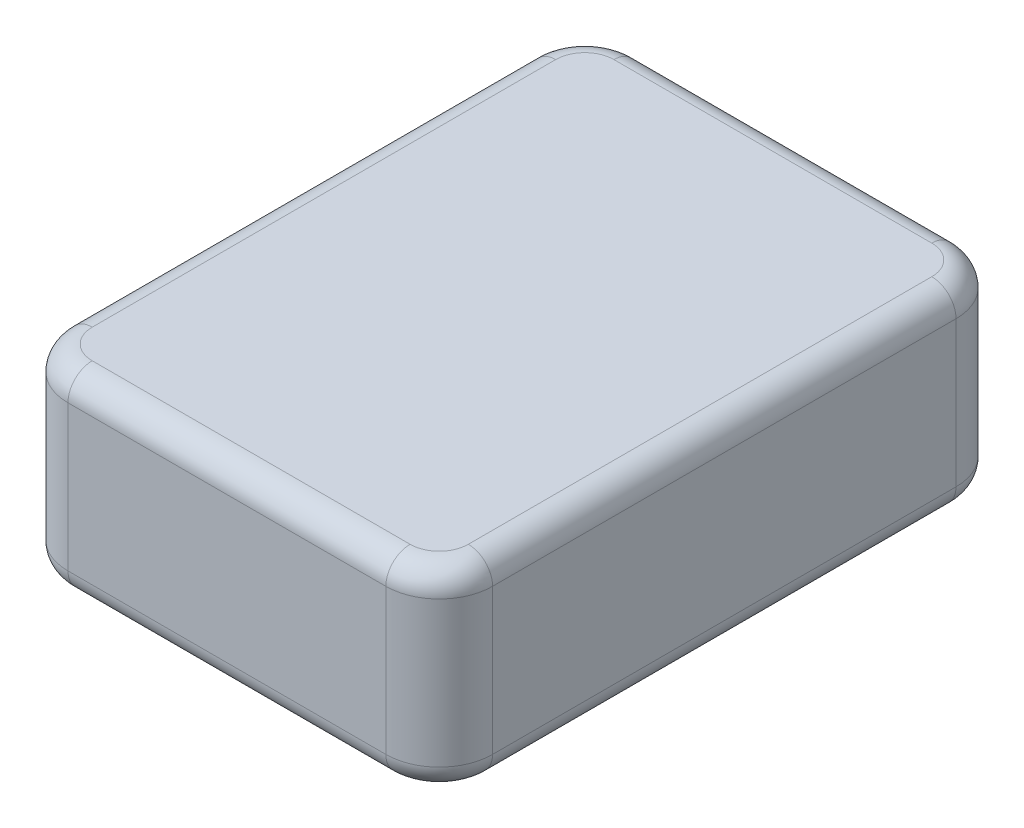
ISO-10303-21;
HEADER;
FILE_DESCRIPTION(('STEP AP214'),'2;1');
FILE_NAME('part.step','',(''),(''),'','','');
FILE_SCHEMA(('AUTOMOTIVE_DESIGN { 1 0 10303 214 1 1 1 1 }'));
ENDSEC;
DATA;
#1=APPLICATION_CONTEXT('core data for automotive mechanical design processes');
#2=APPLICATION_PROTOCOL_DEFINITION('international standard','automotive_design',2000,#1);
#3=PRODUCT_CONTEXT('',#1,'mechanical');
#4=PRODUCT('Part','Part','',(#3));
#5=PRODUCT_RELATED_PRODUCT_CATEGORY('part','',(#4));
#6=PRODUCT_DEFINITION_FORMATION('','',#4);
#7=PRODUCT_DEFINITION_CONTEXT('part definition',#1,'design');
#8=PRODUCT_DEFINITION('design','',#6,#7);
#9=PRODUCT_DEFINITION_SHAPE('','',#8);
#10=(LENGTH_UNIT() NAMED_UNIT(*) SI_UNIT(.MILLI.,.METRE.));
#11=(NAMED_UNIT(*) PLANE_ANGLE_UNIT() SI_UNIT($,.RADIAN.));
#12=(NAMED_UNIT(*) SI_UNIT($,.STERADIAN.) SOLID_ANGLE_UNIT());
#13=UNCERTAINTY_MEASURE_WITH_UNIT(LENGTH_MEASURE(1.E-05),#10,'distance_accuracy_value','');
#14=(GEOMETRIC_REPRESENTATION_CONTEXT(3) GLOBAL_UNCERTAINTY_ASSIGNED_CONTEXT((#13)) GLOBAL_UNIT_ASSIGNED_CONTEXT((#10,
#11,#12)) REPRESENTATION_CONTEXT('',''));
#15=CARTESIAN_POINT('',(0.,0.,0.));
#16=DIRECTION('',(0.,0.,1.));
#17=DIRECTION('',(1.,0.,0.));
#18=AXIS2_PLACEMENT_3D('',#15,#16,#17);
#19=CARTESIAN_POINT('',(0.,203.2,0.));
#20=DIRECTION('',(0.,0.,-1.));
#21=DIRECTION('',(-1.,0.,0.));
#22=AXIS2_PLACEMENT_3D('',#19,#20,#21);
#23=PLANE('',#22);
#24=DIRECTION('',(0.,-1.,0.));
#25=VECTOR('',#24,1.);
#26=CARTESIAN_POINT('',(55.88,0.,0.));
#27=LINE('',#26,#25);
#28=CARTESIAN_POINT('',(55.88,177.8,0.));
#29=VERTEX_POINT('',#28);
#30=CARTESIAN_POINT('',(55.88,25.4,0.));
#31=VERTEX_POINT('',#30);
#32=EDGE_CURVE('E183',#29,#31,#27,.T.);
#33=ORIENTED_EDGE('',*,*,#32,.T.);
#34=DIRECTION('',(1.,0.,0.));
#35=VECTOR('',#34,1.);
#36=CARTESIAN_POINT('',(0.,25.4,0.));
#37=LINE('',#36,#35);
#38=CARTESIAN_POINT('',(388.62,25.4,0.));
#39=VERTEX_POINT('',#38);
#40=EDGE_CURVE('E158',#31,#39,#37,.T.);
#41=ORIENTED_EDGE('',*,*,#40,.T.);
#42=DIRECTION('',(0.,-1.,0.));
#43=VECTOR('',#42,1.);
#44=CARTESIAN_POINT('',(388.62,203.2,0.));
#45=LINE('',#44,#43);
#46=CARTESIAN_POINT('',(388.62,177.8,0.));
#47=VERTEX_POINT('',#46);
#48=EDGE_CURVE('E180',#39,#47,#45,.F.);
#49=ORIENTED_EDGE('',*,*,#48,.T.);
#50=DIRECTION('',(1.,0.,0.));
#51=VECTOR('',#50,1.);
#52=CARTESIAN_POINT('',(55.88,177.8,0.));
#53=LINE('',#52,#51);
#54=EDGE_CURVE('E186',#47,#29,#53,.F.);
#55=ORIENTED_EDGE('',*,*,#54,.T.);
#56=EDGE_LOOP('',(#33,#41,#49,#55));
#57=FACE_BOUND('',#56,.T.);
#58=ADVANCED_FACE('F39',(#57),#23,.F.);
#59=CARTESIAN_POINT('',(444.5,203.2,0.));
#60=DIRECTION('',(-1.,0.,0.));
#61=DIRECTION('',(0.,0.,1.));
#62=AXIS2_PLACEMENT_3D('',#59,#60,#61);
#63=PLANE('',#62);
#64=DIRECTION('',(0.,-1.,0.));
#65=VECTOR('',#64,1.);
#66=CARTESIAN_POINT('',(444.5,203.2,-55.88));
#67=LINE('',#66,#65);
#68=CARTESIAN_POINT('',(444.5,177.8,-55.88));
#69=VERTEX_POINT('',#68);
#70=CARTESIAN_POINT('',(444.5,25.4,-55.88));
#71=VERTEX_POINT('',#70);
#72=EDGE_CURVE('E320',#69,#71,#67,.T.);
#73=ORIENTED_EDGE('',*,*,#72,.T.);
#74=DIRECTION('',(0.,0.,-1.));
#75=VECTOR('',#74,1.);
#76=CARTESIAN_POINT('',(444.5,25.4,0.));
#77=LINE('',#76,#75);
#78=CARTESIAN_POINT('',(444.5,25.4,-541.02));
#79=VERTEX_POINT('',#78);
#80=EDGE_CURVE('E212',#71,#79,#77,.T.);
#81=ORIENTED_EDGE('',*,*,#80,.T.);
#82=DIRECTION('',(0.,-1.,0.));
#83=VECTOR('',#82,1.);
#84=CARTESIAN_POINT('',(444.5,203.2,-541.02));
#85=LINE('',#84,#83);
#86=CARTESIAN_POINT('',(444.5,177.8,-541.02));
#87=VERTEX_POINT('',#86);
#88=EDGE_CURVE('E324',#79,#87,#85,.F.);
#89=ORIENTED_EDGE('',*,*,#88,.T.);
#90=DIRECTION('',(0.,0.,-1.));
#91=VECTOR('',#90,1.);
#92=CARTESIAN_POINT('',(444.5,177.8,-55.88));
#93=LINE('',#92,#91);
#94=EDGE_CURVE('E174',#87,#69,#93,.F.);
#95=ORIENTED_EDGE('',*,*,#94,.T.);
#96=EDGE_LOOP('',(#73,#81,#89,#95));
#97=FACE_BOUND('',#96,.T.);
#98=ADVANCED_FACE('F360',(#97),#63,.F.);
#99=CARTESIAN_POINT('',(0.,203.2,-596.9));
#100=DIRECTION('',(0.,0.,-1.));
#101=DIRECTION('',(-1.,0.,0.));
#102=AXIS2_PLACEMENT_3D('',#99,#100,#101);
#103=PLANE('',#102);
#104=DIRECTION('',(0.,-1.,0.));
#105=VECTOR('',#104,1.);
#106=CARTESIAN_POINT('',(388.62,0.,-596.9));
#107=LINE('',#106,#105);
#108=CARTESIAN_POINT('',(388.62,177.8,-596.9));
#109=VERTEX_POINT('',#108);
#110=CARTESIAN_POINT('',(388.62,25.4,-596.9));
#111=VERTEX_POINT('',#110);
#112=EDGE_CURVE('E318',#109,#111,#107,.T.);
#113=ORIENTED_EDGE('',*,*,#112,.T.);
#114=DIRECTION('',(1.,0.,0.));
#115=VECTOR('',#114,1.);
#116=CARTESIAN_POINT('',(55.88,25.4,-596.9));
#117=LINE('',#116,#115);
#118=CARTESIAN_POINT('',(55.88,25.4,-596.9));
#119=VERTEX_POINT('',#118);
#120=EDGE_CURVE('E221',#111,#119,#117,.F.);
#121=ORIENTED_EDGE('',*,*,#120,.T.);
#122=DIRECTION('',(0.,-1.,0.));
#123=VECTOR('',#122,1.);
#124=CARTESIAN_POINT('',(55.88,203.2,-596.9));
#125=LINE('',#124,#123);
#126=CARTESIAN_POINT('',(55.88,177.8,-596.9));
#127=VERTEX_POINT('',#126);
#128=EDGE_CURVE('E263',#119,#127,#125,.F.);
#129=ORIENTED_EDGE('',*,*,#128,.T.);
#130=DIRECTION('',(1.,0.,0.));
#131=VECTOR('',#130,1.);
#132=CARTESIAN_POINT('',(0.,177.8,-596.9));
#133=LINE('',#132,#131);
#134=EDGE_CURVE('E218',#127,#109,#133,.T.);
#135=ORIENTED_EDGE('',*,*,#134,.T.);
#136=EDGE_LOOP('',(#113,#121,#129,#135));
#137=FACE_BOUND('',#136,.T.);
#138=ADVANCED_FACE('F315',(#137),#103,.T.);
#139=CARTESIAN_POINT('',(0.,203.2,0.));
#140=DIRECTION('',(-1.,0.,0.));
#141=DIRECTION('',(0.,0.,1.));
#142=AXIS2_PLACEMENT_3D('',#139,#140,#141);
#143=PLANE('',#142);
#144=DIRECTION('',(0.,-1.,0.));
#145=VECTOR('',#144,1.);
#146=CARTESIAN_POINT('',(0.,203.2,-541.02));
#147=LINE('',#146,#145);
#148=CARTESIAN_POINT('',(0.,177.8,-541.02));
#149=VERTEX_POINT('',#148);
#150=CARTESIAN_POINT('',(0.,25.4,-541.02));
#151=VERTEX_POINT('',#150);
#152=EDGE_CURVE('E192',#149,#151,#147,.T.);
#153=ORIENTED_EDGE('',*,*,#152,.T.);
#154=DIRECTION('',(0.,0.,-1.));
#155=VECTOR('',#154,1.);
#156=CARTESIAN_POINT('',(0.,25.4,-55.88));
#157=LINE('',#156,#155);
#158=CARTESIAN_POINT('',(0.,25.4,-55.88));
#159=VERTEX_POINT('',#158);
#160=EDGE_CURVE('E229',#151,#159,#157,.F.);
#161=ORIENTED_EDGE('',*,*,#160,.T.);
#162=DIRECTION('',(0.,-1.,0.));
#163=VECTOR('',#162,1.);
#164=CARTESIAN_POINT('',(0.,203.2,-55.88));
#165=LINE('',#164,#163);
#166=CARTESIAN_POINT('',(0.,177.8,-55.88));
#167=VERTEX_POINT('',#166);
#168=EDGE_CURVE('E327',#159,#167,#165,.F.);
#169=ORIENTED_EDGE('',*,*,#168,.T.);
#170=DIRECTION('',(0.,0.,-1.));
#171=VECTOR('',#170,1.);
#172=CARTESIAN_POINT('',(0.,177.8,0.));
#173=LINE('',#172,#171);
#174=EDGE_CURVE('E227',#167,#149,#173,.T.);
#175=ORIENTED_EDGE('',*,*,#174,.T.);
#176=EDGE_LOOP('',(#153,#161,#169,#175));
#177=FACE_BOUND('',#176,.T.);
#178=ADVANCED_FACE('F331',(#177),#143,.T.);
#179=CARTESIAN_POINT('',(0.,203.2,0.));
#180=DIRECTION('',(0.,1.,0.));
#181=DIRECTION('',(0.,0.,1.));
#182=AXIS2_PLACEMENT_3D('',#179,#180,#181);
#183=PLANE('',#182);
#184=CARTESIAN_POINT('',(388.62,203.2,-541.02));
#185=DIRECTION('',(0.,1.,0.));
#186=DIRECTION('',(0.,0.,1.));
#187=AXIS2_PLACEMENT_3D('',#184,#185,#186);
#188=CIRCLE('',#187,30.48);
#189=CARTESIAN_POINT('',(419.1,203.2,-541.02));
#190=VERTEX_POINT('',#189);
#191=CARTESIAN_POINT('',(388.62,203.2,-571.5));
#192=VERTEX_POINT('',#191);
#193=EDGE_CURVE('E56',#190,#192,#188,.T.);
#194=ORIENTED_EDGE('',*,*,#193,.T.);
#195=DIRECTION('',(1.,0.,0.));
#196=VECTOR('',#195,1.);
#197=CARTESIAN_POINT('',(0.,203.2,-571.5));
#198=LINE('',#197,#196);
#199=CARTESIAN_POINT('',(55.88,203.2,-571.5));
#200=VERTEX_POINT('',#199);
#201=EDGE_CURVE('E243',#192,#200,#198,.F.);
#202=ORIENTED_EDGE('',*,*,#201,.T.);
#203=CARTESIAN_POINT('',(55.88,203.2,-541.02));
#204=DIRECTION('',(0.,1.,0.));
#205=DIRECTION('',(0.,0.,1.));
#206=AXIS2_PLACEMENT_3D('',#203,#204,#205);
#207=CIRCLE('',#206,30.48);
#208=CARTESIAN_POINT('',(25.4,203.2,-541.02));
#209=VERTEX_POINT('',#208);
#210=EDGE_CURVE('E231',#200,#209,#207,.T.);
#211=ORIENTED_EDGE('',*,*,#210,.T.);
#212=DIRECTION('',(0.,0.,-1.));
#213=VECTOR('',#212,1.);
#214=CARTESIAN_POINT('',(25.4,203.2,0.));
#215=LINE('',#214,#213);
#216=CARTESIAN_POINT('',(25.4,203.2,-55.88));
#217=VERTEX_POINT('',#216);
#218=EDGE_CURVE('E233',#209,#217,#215,.F.);
#219=ORIENTED_EDGE('',*,*,#218,.T.);
#220=CARTESIAN_POINT('',(55.88,203.2,-55.88));
#221=DIRECTION('',(0.,1.,0.));
#222=DIRECTION('',(0.,0.,1.));
#223=AXIS2_PLACEMENT_3D('',#220,#221,#222);
#224=CIRCLE('',#223,30.48);
#225=CARTESIAN_POINT('',(55.88,203.2,-25.4));
#226=VERTEX_POINT('',#225);
#227=EDGE_CURVE('E235',#217,#226,#224,.T.);
#228=ORIENTED_EDGE('',*,*,#227,.T.);
#229=DIRECTION('',(1.,0.,0.));
#230=VECTOR('',#229,1.);
#231=CARTESIAN_POINT('',(388.62,203.2,-25.4));
#232=LINE('',#231,#230);
#233=CARTESIAN_POINT('',(388.62,203.2,-25.4));
#234=VERTEX_POINT('',#233);
#235=EDGE_CURVE('E237',#226,#234,#232,.T.);
#236=ORIENTED_EDGE('',*,*,#235,.T.);
#237=CARTESIAN_POINT('',(388.62,203.2,-55.88));
#238=DIRECTION('',(0.,1.,0.));
#239=DIRECTION('',(0.,0.,1.));
#240=AXIS2_PLACEMENT_3D('',#237,#238,#239);
#241=CIRCLE('',#240,30.48);
#242=CARTESIAN_POINT('',(419.1,203.2,-55.88));
#243=VERTEX_POINT('',#242);
#244=EDGE_CURVE('E239',#234,#243,#241,.T.);
#245=ORIENTED_EDGE('',*,*,#244,.T.);
#246=DIRECTION('',(0.,0.,-1.));
#247=VECTOR('',#246,1.);
#248=CARTESIAN_POINT('',(419.1,203.2,-541.02));
#249=LINE('',#248,#247);
#250=EDGE_CURVE('E61',#243,#190,#249,.T.);
#251=ORIENTED_EDGE('',*,*,#250,.T.);
#252=EDGE_LOOP('',(#194,#202,#211,#219,#228,#236,#245,#251));
#253=FACE_BOUND('',#252,.T.);
#254=ADVANCED_FACE('F293',(#253),#183,.T.);
#255=CARTESIAN_POINT('',(0.,0.,0.));
#256=DIRECTION('',(0.,1.,0.));
#257=DIRECTION('',(0.,0.,1.));
#258=AXIS2_PLACEMENT_3D('',#255,#256,#257);
#259=PLANE('',#258);
#260=CARTESIAN_POINT('',(388.62,0.,-55.88));
#261=DIRECTION('',(0.,1.,0.));
#262=DIRECTION('',(0.,0.,1.));
#263=AXIS2_PLACEMENT_3D('',#260,#261,#262);
#264=CIRCLE('',#263,30.48);
#265=CARTESIAN_POINT('',(419.1,0.,-55.88));
#266=VERTEX_POINT('',#265);
#267=CARTESIAN_POINT('',(388.62,0.,-25.4));
#268=VERTEX_POINT('',#267);
#269=EDGE_CURVE('E207',#266,#268,#264,.F.);
#270=ORIENTED_EDGE('',*,*,#269,.T.);
#271=DIRECTION('',(1.,0.,0.));
#272=VECTOR('',#271,1.);
#273=CARTESIAN_POINT('',(0.,0.,-25.4));
#274=LINE('',#273,#272);
#275=CARTESIAN_POINT('',(55.88,0.,-25.4));
#276=VERTEX_POINT('',#275);
#277=EDGE_CURVE('E160',#268,#276,#274,.F.);
#278=ORIENTED_EDGE('',*,*,#277,.T.);
#279=CARTESIAN_POINT('',(55.88,0.,-55.88));
#280=DIRECTION('',(0.,1.,0.));
#281=DIRECTION('',(0.,0.,1.));
#282=AXIS2_PLACEMENT_3D('',#279,#280,#281);
#283=CIRCLE('',#282,30.48);
#284=CARTESIAN_POINT('',(25.4,0.,-55.88));
#285=VERTEX_POINT('',#284);
#286=EDGE_CURVE('E185',#276,#285,#283,.F.);
#287=ORIENTED_EDGE('',*,*,#286,.T.);
#288=DIRECTION('',(0.,0.,-1.));
#289=VECTOR('',#288,1.);
#290=CARTESIAN_POINT('',(25.4,0.,-541.02));
#291=LINE('',#290,#289);
#292=CARTESIAN_POINT('',(25.4,0.,-541.02));
#293=VERTEX_POINT('',#292);
#294=EDGE_CURVE('E197',#285,#293,#291,.T.);
#295=ORIENTED_EDGE('',*,*,#294,.T.);
#296=CARTESIAN_POINT('',(55.88,0.,-541.02));
#297=DIRECTION('',(0.,1.,0.));
#298=DIRECTION('',(0.,0.,1.));
#299=AXIS2_PLACEMENT_3D('',#296,#297,#298);
#300=CIRCLE('',#299,30.48);
#301=CARTESIAN_POINT('',(55.88,0.,-571.5));
#302=VERTEX_POINT('',#301);
#303=EDGE_CURVE('E199',#293,#302,#300,.F.);
#304=ORIENTED_EDGE('',*,*,#303,.T.);
#305=DIRECTION('',(1.,0.,0.));
#306=VECTOR('',#305,1.);
#307=CARTESIAN_POINT('',(388.62,0.,-571.5));
#308=LINE('',#307,#306);
#309=CARTESIAN_POINT('',(388.62,0.,-571.5));
#310=VERTEX_POINT('',#309);
#311=EDGE_CURVE('E201',#302,#310,#308,.T.);
#312=ORIENTED_EDGE('',*,*,#311,.T.);
#313=CARTESIAN_POINT('',(388.62,0.,-541.02));
#314=DIRECTION('',(0.,1.,0.));
#315=DIRECTION('',(0.,0.,1.));
#316=AXIS2_PLACEMENT_3D('',#313,#314,#315);
#317=CIRCLE('',#316,30.48);
#318=CARTESIAN_POINT('',(419.1,0.,-541.02));
#319=VERTEX_POINT('',#318);
#320=EDGE_CURVE('E203',#310,#319,#317,.F.);
#321=ORIENTED_EDGE('',*,*,#320,.T.);
#322=DIRECTION('',(0.,0.,-1.));
#323=VECTOR('',#322,1.);
#324=CARTESIAN_POINT('',(419.1,0.,0.));
#325=LINE('',#324,#323);
#326=EDGE_CURVE('E205',#319,#266,#325,.F.);
#327=ORIENTED_EDGE('',*,*,#326,.T.);
#328=EDGE_LOOP('',(#270,#278,#287,#295,#304,#312,#321,#327));
#329=FACE_BOUND('',#328,.T.);
#330=ADVANCED_FACE('F372',(#329),#259,.F.);
#331=CARTESIAN_POINT('',(388.62,203.2,-541.02));
#332=DIRECTION('',(0.,1.,0.));
#333=DIRECTION('',(0.,0.,1.));
#334=AXIS2_PLACEMENT_3D('',#331,#332,#333);
#335=CYLINDRICAL_SURFACE('',#334,55.88);
#336=ORIENTED_EDGE('',*,*,#88,.F.);
#337=CARTESIAN_POINT('',(388.62,25.4,-541.02));
#338=DIRECTION('',(0.,1.,0.));
#339=DIRECTION('',(0.,0.,1.));
#340=AXIS2_PLACEMENT_3D('',#337,#338,#339);
#341=CIRCLE('',#340,55.88);
#342=EDGE_CURVE('E216',#79,#111,#341,.T.);
#343=ORIENTED_EDGE('',*,*,#342,.T.);
#344=ORIENTED_EDGE('',*,*,#112,.F.);
#345=CARTESIAN_POINT('',(388.62,177.8,-541.02));
#346=DIRECTION('',(0.,1.,0.));
#347=DIRECTION('',(0.,0.,1.));
#348=AXIS2_PLACEMENT_3D('',#345,#346,#347);
#349=CIRCLE('',#348,55.88);
#350=EDGE_CURVE('E214',#109,#87,#349,.F.);
#351=ORIENTED_EDGE('',*,*,#350,.T.);
#352=EDGE_LOOP('',(#336,#343,#344,#351));
#353=FACE_BOUND('',#352,.T.);
#354=ADVANCED_FACE('F369',(#353),#335,.T.);
#355=CARTESIAN_POINT('',(55.88,203.2,-541.02));
#356=DIRECTION('',(0.,-1.,0.));
#357=DIRECTION('',(0.,0.,-1.));
#358=AXIS2_PLACEMENT_3D('',#355,#356,#357);
#359=CYLINDRICAL_SURFACE('',#358,55.88);
#360=ORIENTED_EDGE('',*,*,#128,.F.);
#361=CARTESIAN_POINT('',(55.88,25.4,-541.02));
#362=DIRECTION('',(0.,1.,0.));
#363=DIRECTION('',(0.,0.,1.));
#364=AXIS2_PLACEMENT_3D('',#361,#362,#363);
#365=CIRCLE('',#364,55.88);
#366=EDGE_CURVE('E225',#119,#151,#365,.T.);
#367=ORIENTED_EDGE('',*,*,#366,.T.);
#368=ORIENTED_EDGE('',*,*,#152,.F.);
#369=CARTESIAN_POINT('',(55.88,177.8,-541.02));
#370=DIRECTION('',(0.,1.,0.));
#371=DIRECTION('',(0.,0.,1.));
#372=AXIS2_PLACEMENT_3D('',#369,#370,#371);
#373=CIRCLE('',#372,55.88);
#374=EDGE_CURVE('E223',#149,#127,#373,.F.);
#375=ORIENTED_EDGE('',*,*,#374,.T.);
#376=EDGE_LOOP('',(#360,#367,#368,#375));
#377=FACE_BOUND('',#376,.T.);
#378=ADVANCED_FACE('F310',(#377),#359,.T.);
#379=CARTESIAN_POINT('',(388.62,203.2,-55.88));
#380=DIRECTION('',(0.,-1.,0.));
#381=DIRECTION('',(0.,0.,-1.));
#382=AXIS2_PLACEMENT_3D('',#379,#380,#381);
#383=CYLINDRICAL_SURFACE('',#382,55.88);
#384=ORIENTED_EDGE('',*,*,#48,.F.);
#385=CARTESIAN_POINT('',(388.62,25.4,-55.88));
#386=DIRECTION('',(0.,1.,0.));
#387=DIRECTION('',(0.,0.,1.));
#388=AXIS2_PLACEMENT_3D('',#385,#386,#387);
#389=CIRCLE('',#388,55.88);
#390=EDGE_CURVE('E166',#39,#71,#389,.T.);
#391=ORIENTED_EDGE('',*,*,#390,.T.);
#392=ORIENTED_EDGE('',*,*,#72,.F.);
#393=CARTESIAN_POINT('',(388.62,177.8,-55.88));
#394=DIRECTION('',(0.,1.,0.));
#395=DIRECTION('',(0.,0.,1.));
#396=AXIS2_PLACEMENT_3D('',#393,#394,#395);
#397=CIRCLE('',#396,55.88);
#398=EDGE_CURVE('E175',#69,#47,#397,.F.);
#399=ORIENTED_EDGE('',*,*,#398,.T.);
#400=EDGE_LOOP('',(#384,#391,#392,#399));
#401=FACE_BOUND('',#400,.T.);
#402=ADVANCED_FACE('F188',(#401),#383,.T.);
#403=CARTESIAN_POINT('',(55.88,203.2,-55.88));
#404=DIRECTION('',(0.,1.,0.));
#405=DIRECTION('',(0.,0.,1.));
#406=AXIS2_PLACEMENT_3D('',#403,#404,#405);
#407=CYLINDRICAL_SURFACE('',#406,55.88);
#408=ORIENTED_EDGE('',*,*,#32,.F.);
#409=CARTESIAN_POINT('',(55.88,177.8,-55.88));
#410=DIRECTION('',(0.,1.,0.));
#411=DIRECTION('',(0.,0.,1.));
#412=AXIS2_PLACEMENT_3D('',#409,#410,#411);
#413=CIRCLE('',#412,55.88);
#414=EDGE_CURVE('E11',#29,#167,#413,.F.);
#415=ORIENTED_EDGE('',*,*,#414,.T.);
#416=ORIENTED_EDGE('',*,*,#168,.F.);
#417=CARTESIAN_POINT('',(55.88,25.4,-55.88));
#418=DIRECTION('',(0.,1.,0.));
#419=DIRECTION('',(0.,0.,1.));
#420=AXIS2_PLACEMENT_3D('',#417,#418,#419);
#421=CIRCLE('',#420,55.88);
#422=EDGE_CURVE('E48',#159,#31,#421,.T.);
#423=ORIENTED_EDGE('',*,*,#422,.T.);
#424=EDGE_LOOP('',(#408,#415,#416,#423));
#425=FACE_BOUND('',#424,.T.);
#426=ADVANCED_FACE('F347',(#425),#407,.T.);
#427=CARTESIAN_POINT('',(0.,25.4,-571.5));
#428=DIRECTION('',(-1.,0.,0.));
#429=DIRECTION('',(0.,0.,1.));
#430=AXIS2_PLACEMENT_3D('',#427,#428,#429);
#431=CYLINDRICAL_SURFACE('',#430,25.4);
#432=CARTESIAN_POINT('',(388.62,25.4,-571.5));
#433=DIRECTION('',(1.,0.,0.));
#434=DIRECTION('',(0.,0.,-1.));
#435=AXIS2_PLACEMENT_3D('',#432,#433,#434);
#436=CIRCLE('',#435,25.4);
#437=EDGE_CURVE('E257',#310,#111,#436,.T.);
#438=ORIENTED_EDGE('',*,*,#437,.F.);
#439=ORIENTED_EDGE('',*,*,#311,.F.);
#440=CARTESIAN_POINT('',(55.88,25.4,-571.5));
#441=DIRECTION('',(-1.,0.,0.));
#442=DIRECTION('',(0.,0.,1.));
#443=AXIS2_PLACEMENT_3D('',#440,#441,#442);
#444=CIRCLE('',#443,25.4);
#445=EDGE_CURVE('E260',#119,#302,#444,.T.);
#446=ORIENTED_EDGE('',*,*,#445,.F.);
#447=ORIENTED_EDGE('',*,*,#120,.F.);
#448=EDGE_LOOP('',(#438,#439,#446,#447));
#449=FACE_BOUND('',#448,.T.);
#450=ADVANCED_FACE('F349',(#449),#431,.T.);
#451=CARTESIAN_POINT('',(55.88,25.4,-541.02));
#452=DIRECTION('',(0.,1.,0.));
#453=DIRECTION('',(0.,0.,1.));
#454=AXIS2_PLACEMENT_3D('',#451,#452,#453);
#455=TOROIDAL_SURFACE('',#454,30.48,25.4);
#456=ORIENTED_EDGE('',*,*,#445,.T.);
#457=ORIENTED_EDGE('',*,*,#303,.F.);
#458=CARTESIAN_POINT('',(25.4,25.4,-541.02));
#459=DIRECTION('',(0.,0.,1.));
#460=DIRECTION('',(1.,0.,0.));
#461=AXIS2_PLACEMENT_3D('',#458,#459,#460);
#462=CIRCLE('',#461,25.4);
#463=EDGE_CURVE('E254',#151,#293,#462,.T.);
#464=ORIENTED_EDGE('',*,*,#463,.F.);
#465=ORIENTED_EDGE('',*,*,#366,.F.);
#466=EDGE_LOOP('',(#456,#457,#464,#465));
#467=FACE_BOUND('',#466,.T.);
#468=ADVANCED_FACE('F337',(#467),#455,.T.);
#469=CARTESIAN_POINT('',(388.62,25.4,-541.02));
#470=DIRECTION('',(0.,1.,0.));
#471=DIRECTION('',(0.,0.,1.));
#472=AXIS2_PLACEMENT_3D('',#469,#470,#471);
#473=TOROIDAL_SURFACE('',#472,30.48,25.4);
#474=ORIENTED_EDGE('',*,*,#437,.T.);
#475=ORIENTED_EDGE('',*,*,#342,.F.);
#476=CARTESIAN_POINT('',(419.1,25.4,-541.02));
#477=DIRECTION('',(0.,0.,1.));
#478=DIRECTION('',(1.,0.,0.));
#479=AXIS2_PLACEMENT_3D('',#476,#477,#478);
#480=CIRCLE('',#479,25.4);
#481=EDGE_CURVE('E251',#319,#79,#480,.T.);
#482=ORIENTED_EDGE('',*,*,#481,.F.);
#483=ORIENTED_EDGE('',*,*,#320,.F.);
#484=EDGE_LOOP('',(#474,#475,#482,#483));
#485=FACE_BOUND('',#484,.T.);
#486=ADVANCED_FACE('F403',(#485),#473,.T.);
#487=CARTESIAN_POINT('',(25.4,25.4,0.));
#488=DIRECTION('',(0.,0.,1.));
#489=DIRECTION('',(1.,0.,0.));
#490=AXIS2_PLACEMENT_3D('',#487,#488,#489);
#491=CYLINDRICAL_SURFACE('',#490,25.4);
#492=ORIENTED_EDGE('',*,*,#463,.T.);
#493=ORIENTED_EDGE('',*,*,#294,.F.);
#494=CARTESIAN_POINT('',(25.4,25.4,-55.88));
#495=DIRECTION('',(0.,0.,1.));
#496=DIRECTION('',(1.,0.,0.));
#497=AXIS2_PLACEMENT_3D('',#494,#495,#496);
#498=CIRCLE('',#497,25.4);
#499=EDGE_CURVE('E248',#159,#285,#498,.T.);
#500=ORIENTED_EDGE('',*,*,#499,.F.);
#501=ORIENTED_EDGE('',*,*,#160,.F.);
#502=EDGE_LOOP('',(#492,#493,#500,#501));
#503=FACE_BOUND('',#502,.T.);
#504=ADVANCED_FACE('F341',(#503),#491,.T.);
#505=CARTESIAN_POINT('',(419.1,25.4,0.));
#506=DIRECTION('',(0.,0.,-1.));
#507=DIRECTION('',(-1.,0.,0.));
#508=AXIS2_PLACEMENT_3D('',#505,#506,#507);
#509=CYLINDRICAL_SURFACE('',#508,25.4);
#510=ORIENTED_EDGE('',*,*,#481,.T.);
#511=ORIENTED_EDGE('',*,*,#80,.F.);
#512=CARTESIAN_POINT('',(419.1,25.4,-55.88));
#513=DIRECTION('',(0.,0.,1.));
#514=DIRECTION('',(1.,0.,0.));
#515=AXIS2_PLACEMENT_3D('',#512,#513,#514);
#516=CIRCLE('',#515,25.4);
#517=EDGE_CURVE('E169',#266,#71,#516,.T.);
#518=ORIENTED_EDGE('',*,*,#517,.F.);
#519=ORIENTED_EDGE('',*,*,#326,.F.);
#520=EDGE_LOOP('',(#510,#511,#518,#519));
#521=FACE_BOUND('',#520,.T.);
#522=ADVANCED_FACE('F423',(#521),#509,.T.);
#523=CARTESIAN_POINT('',(55.88,25.4,-55.88));
#524=DIRECTION('',(0.,1.,0.));
#525=DIRECTION('',(0.,0.,1.));
#526=AXIS2_PLACEMENT_3D('',#523,#524,#525);
#527=TOROIDAL_SURFACE('',#526,30.48,25.4);
#528=ORIENTED_EDGE('',*,*,#499,.T.);
#529=ORIENTED_EDGE('',*,*,#286,.F.);
#530=CARTESIAN_POINT('',(55.88,25.4,-25.4));
#531=DIRECTION('',(1.,0.,0.));
#532=DIRECTION('',(0.,0.,-1.));
#533=AXIS2_PLACEMENT_3D('',#530,#531,#532);
#534=CIRCLE('',#533,25.4);
#535=EDGE_CURVE('E163',#31,#276,#534,.T.);
#536=ORIENTED_EDGE('',*,*,#535,.F.);
#537=ORIENTED_EDGE('',*,*,#422,.F.);
#538=EDGE_LOOP('',(#528,#529,#536,#537));
#539=FACE_BOUND('',#538,.T.);
#540=ADVANCED_FACE('F345',(#539),#527,.T.);
#541=CARTESIAN_POINT('',(388.62,25.4,-55.88));
#542=DIRECTION('',(0.,1.,0.));
#543=DIRECTION('',(0.,0.,1.));
#544=AXIS2_PLACEMENT_3D('',#541,#542,#543);
#545=TOROIDAL_SURFACE('',#544,30.48,25.4);
#546=ORIENTED_EDGE('',*,*,#517,.T.);
#547=ORIENTED_EDGE('',*,*,#390,.F.);
#548=CARTESIAN_POINT('',(388.62,25.4,-25.4));
#549=DIRECTION('',(-1.,0.,0.));
#550=DIRECTION('',(0.,0.,1.));
#551=AXIS2_PLACEMENT_3D('',#548,#549,#550);
#552=CIRCLE('',#551,25.4);
#553=EDGE_CURVE('E154',#268,#39,#552,.T.);
#554=ORIENTED_EDGE('',*,*,#553,.F.);
#555=ORIENTED_EDGE('',*,*,#269,.F.);
#556=EDGE_LOOP('',(#546,#547,#554,#555));
#557=FACE_BOUND('',#556,.T.);
#558=ADVANCED_FACE('F167',(#557),#545,.T.);
#559=CARTESIAN_POINT('',(0.,25.4,-25.4));
#560=DIRECTION('',(1.,0.,0.));
#561=DIRECTION('',(0.,0.,-1.));
#562=AXIS2_PLACEMENT_3D('',#559,#560,#561);
#563=CYLINDRICAL_SURFACE('',#562,25.4);
#564=ORIENTED_EDGE('',*,*,#535,.T.);
#565=ORIENTED_EDGE('',*,*,#277,.F.);
#566=ORIENTED_EDGE('',*,*,#553,.T.);
#567=ORIENTED_EDGE('',*,*,#40,.F.);
#568=EDGE_LOOP('',(#564,#565,#566,#567));
#569=FACE_BOUND('',#568,.T.);
#570=ADVANCED_FACE('F156',(#569),#563,.T.);
#571=CARTESIAN_POINT('',(0.,177.8,-25.4));
#572=DIRECTION('',(-1.,0.,0.));
#573=DIRECTION('',(0.,0.,1.));
#574=AXIS2_PLACEMENT_3D('',#571,#572,#573);
#575=CYLINDRICAL_SURFACE('',#574,25.4);
#576=CARTESIAN_POINT('',(388.62,177.8,-25.4));
#577=DIRECTION('',(1.,0.,0.));
#578=DIRECTION('',(0.,0.,-1.));
#579=AXIS2_PLACEMENT_3D('',#576,#577,#578);
#580=CIRCLE('',#579,25.4);
#581=EDGE_CURVE('E279',#234,#47,#580,.T.);
#582=ORIENTED_EDGE('',*,*,#581,.F.);
#583=ORIENTED_EDGE('',*,*,#235,.F.);
#584=CARTESIAN_POINT('',(55.88,177.8,-25.4));
#585=DIRECTION('',(-1.,0.,0.));
#586=DIRECTION('',(0.,0.,1.));
#587=AXIS2_PLACEMENT_3D('',#584,#585,#586);
#588=CIRCLE('',#587,25.4);
#589=EDGE_CURVE('E43',#29,#226,#588,.T.);
#590=ORIENTED_EDGE('',*,*,#589,.F.);
#591=ORIENTED_EDGE('',*,*,#54,.F.);
#592=EDGE_LOOP('',(#582,#583,#590,#591));
#593=FACE_BOUND('',#592,.T.);
#594=ADVANCED_FACE('F41',(#593),#575,.T.);
#595=CARTESIAN_POINT('',(55.88,177.8,-55.88));
#596=DIRECTION('',(0.,1.,0.));
#597=DIRECTION('',(0.,0.,1.));
#598=AXIS2_PLACEMENT_3D('',#595,#596,#597);
#599=TOROIDAL_SURFACE('',#598,30.48,25.4);
#600=ORIENTED_EDGE('',*,*,#589,.T.);
#601=ORIENTED_EDGE('',*,*,#227,.F.);
#602=CARTESIAN_POINT('',(25.4,177.8,-55.88));
#603=DIRECTION('',(0.,0.,-1.));
#604=DIRECTION('',(-1.,0.,0.));
#605=AXIS2_PLACEMENT_3D('',#602,#603,#604);
#606=CIRCLE('',#605,25.4);
#607=EDGE_CURVE('E277',#167,#217,#606,.T.);
#608=ORIENTED_EDGE('',*,*,#607,.F.);
#609=ORIENTED_EDGE('',*,*,#414,.F.);
#610=EDGE_LOOP('',(#600,#601,#608,#609));
#611=FACE_BOUND('',#610,.T.);
#612=ADVANCED_FACE('F289',(#611),#599,.T.);
#613=CARTESIAN_POINT('',(388.62,177.8,-55.88));
#614=DIRECTION('',(0.,1.,0.));
#615=DIRECTION('',(0.,0.,1.));
#616=AXIS2_PLACEMENT_3D('',#613,#614,#615);
#617=TOROIDAL_SURFACE('',#616,30.48,25.4);
#618=ORIENTED_EDGE('',*,*,#581,.T.);
#619=ORIENTED_EDGE('',*,*,#398,.F.);
#620=CARTESIAN_POINT('',(419.1,177.8,-55.88));
#621=DIRECTION('',(0.,0.,-1.));
#622=DIRECTION('',(-1.,0.,0.));
#623=AXIS2_PLACEMENT_3D('',#620,#621,#622);
#624=CIRCLE('',#623,25.4);
#625=EDGE_CURVE('E274',#243,#69,#624,.T.);
#626=ORIENTED_EDGE('',*,*,#625,.F.);
#627=ORIENTED_EDGE('',*,*,#244,.F.);
#628=EDGE_LOOP('',(#618,#619,#626,#627));
#629=FACE_BOUND('',#628,.T.);
#630=ADVANCED_FACE('F473',(#629),#617,.T.);
#631=CARTESIAN_POINT('',(25.4,177.8,0.));
#632=DIRECTION('',(0.,0.,-1.));
#633=DIRECTION('',(-1.,0.,0.));
#634=AXIS2_PLACEMENT_3D('',#631,#632,#633);
#635=CYLINDRICAL_SURFACE('',#634,25.4);
#636=ORIENTED_EDGE('',*,*,#607,.T.);
#637=ORIENTED_EDGE('',*,*,#218,.F.);
#638=CARTESIAN_POINT('',(25.4,177.8,-541.02));
#639=DIRECTION('',(0.,0.,-1.));
#640=DIRECTION('',(-1.,0.,0.));
#641=AXIS2_PLACEMENT_3D('',#638,#639,#640);
#642=CIRCLE('',#641,25.4);
#643=EDGE_CURVE('E271',#149,#209,#642,.T.);
#644=ORIENTED_EDGE('',*,*,#643,.F.);
#645=ORIENTED_EDGE('',*,*,#174,.F.);
#646=EDGE_LOOP('',(#636,#637,#644,#645));
#647=FACE_BOUND('',#646,.T.);
#648=ADVANCED_FACE('F299',(#647),#635,.T.);
#649=CARTESIAN_POINT('',(419.1,177.8,0.));
#650=DIRECTION('',(0.,0.,1.));
#651=DIRECTION('',(1.,0.,0.));
#652=AXIS2_PLACEMENT_3D('',#649,#650,#651);
#653=CYLINDRICAL_SURFACE('',#652,25.4);
#654=ORIENTED_EDGE('',*,*,#625,.T.);
#655=ORIENTED_EDGE('',*,*,#94,.F.);
#656=CARTESIAN_POINT('',(419.1,177.8,-541.02));
#657=DIRECTION('',(0.,0.,-1.));
#658=DIRECTION('',(-1.,0.,0.));
#659=AXIS2_PLACEMENT_3D('',#656,#657,#658);
#660=CIRCLE('',#659,25.4);
#661=EDGE_CURVE('E268',#190,#87,#660,.T.);
#662=ORIENTED_EDGE('',*,*,#661,.F.);
#663=ORIENTED_EDGE('',*,*,#250,.F.);
#664=EDGE_LOOP('',(#654,#655,#662,#663));
#665=FACE_BOUND('',#664,.T.);
#666=ADVANCED_FACE('F491',(#665),#653,.T.);
#667=CARTESIAN_POINT('',(55.88,177.8,-541.02));
#668=DIRECTION('',(0.,1.,0.));
#669=DIRECTION('',(0.,0.,1.));
#670=AXIS2_PLACEMENT_3D('',#667,#668,#669);
#671=TOROIDAL_SURFACE('',#670,30.48,25.4);
#672=ORIENTED_EDGE('',*,*,#643,.T.);
#673=ORIENTED_EDGE('',*,*,#210,.F.);
#674=CARTESIAN_POINT('',(55.88,177.8,-571.5));
#675=DIRECTION('',(1.,0.,0.));
#676=DIRECTION('',(0.,0.,-1.));
#677=AXIS2_PLACEMENT_3D('',#674,#675,#676);
#678=CIRCLE('',#677,25.4);
#679=EDGE_CURVE('E266',#127,#200,#678,.T.);
#680=ORIENTED_EDGE('',*,*,#679,.F.);
#681=ORIENTED_EDGE('',*,*,#374,.F.);
#682=EDGE_LOOP('',(#672,#673,#680,#681));
#683=FACE_BOUND('',#682,.T.);
#684=ADVANCED_FACE('F303',(#683),#671,.T.);
#685=CARTESIAN_POINT('',(388.62,177.8,-541.02));
#686=DIRECTION('',(0.,1.,0.));
#687=DIRECTION('',(0.,0.,1.));
#688=AXIS2_PLACEMENT_3D('',#685,#686,#687);
#689=TOROIDAL_SURFACE('',#688,30.48,25.4);
#690=ORIENTED_EDGE('',*,*,#661,.T.);
#691=ORIENTED_EDGE('',*,*,#350,.F.);
#692=CARTESIAN_POINT('',(388.62,177.8,-571.5));
#693=DIRECTION('',(-1.,0.,0.));
#694=DIRECTION('',(0.,0.,1.));
#695=AXIS2_PLACEMENT_3D('',#692,#693,#694);
#696=CIRCLE('',#695,25.4);
#697=EDGE_CURVE('E264',#192,#109,#696,.T.);
#698=ORIENTED_EDGE('',*,*,#697,.F.);
#699=ORIENTED_EDGE('',*,*,#193,.F.);
#700=EDGE_LOOP('',(#690,#691,#698,#699));
#701=FACE_BOUND('',#700,.T.);
#702=ADVANCED_FACE('F509',(#701),#689,.T.);
#703=CARTESIAN_POINT('',(0.,177.8,-571.5));
#704=DIRECTION('',(1.,0.,0.));
#705=DIRECTION('',(0.,0.,-1.));
#706=AXIS2_PLACEMENT_3D('',#703,#704,#705);
#707=CYLINDRICAL_SURFACE('',#706,25.4);
#708=ORIENTED_EDGE('',*,*,#679,.T.);
#709=ORIENTED_EDGE('',*,*,#201,.F.);
#710=ORIENTED_EDGE('',*,*,#697,.T.);
#711=ORIENTED_EDGE('',*,*,#134,.F.);
#712=EDGE_LOOP('',(#708,#709,#710,#711));
#713=FACE_BOUND('',#712,.T.);
#714=ADVANCED_FACE('F519',(#713),#707,.T.);
#715=CLOSED_SHELL('',(#58,#98,#138,#178,#254,#330,#354,#378,#402,#426,#450,#468,#486,#504,#522,
#540,#558,#570,#594,#612,#630,#648,#666,#684,#702,#714));
#716=MANIFOLD_SOLID_BREP('B2',#715);
#717=ADVANCED_BREP_SHAPE_REPRESENTATION('',(#18,#716),#14);
#718=SHAPE_DEFINITION_REPRESENTATION(#9,#717);
ENDSEC;
END-ISO-10303-21;
